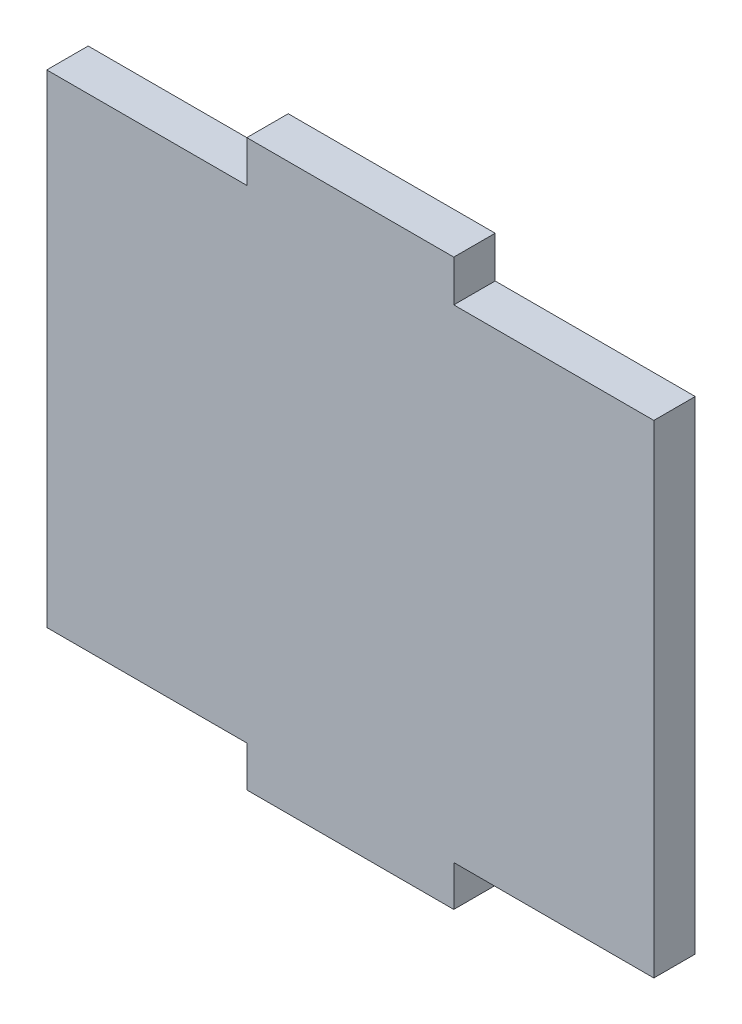
ISO-10303-21;
HEADER;
FILE_DESCRIPTION(('STEP AP214'),'2;1');
FILE_NAME('part.step','',(''),(''),'','','');
FILE_SCHEMA(('AUTOMOTIVE_DESIGN { 1 0 10303 214 1 1 1 1 }'));
ENDSEC;
DATA;
#1=APPLICATION_CONTEXT('core data for automotive mechanical design processes');
#2=APPLICATION_PROTOCOL_DEFINITION('international standard','automotive_design',2000,#1);
#3=PRODUCT_CONTEXT('',#1,'mechanical');
#4=PRODUCT('Part','Part','',(#3));
#5=PRODUCT_RELATED_PRODUCT_CATEGORY('part','',(#4));
#6=PRODUCT_DEFINITION_FORMATION('','',#4);
#7=PRODUCT_DEFINITION_CONTEXT('part definition',#1,'design');
#8=PRODUCT_DEFINITION('design','',#6,#7);
#9=PRODUCT_DEFINITION_SHAPE('','',#8);
#10=(LENGTH_UNIT() NAMED_UNIT(*) SI_UNIT(.MILLI.,.METRE.));
#11=(NAMED_UNIT(*) PLANE_ANGLE_UNIT() SI_UNIT($,.RADIAN.));
#12=(NAMED_UNIT(*) SI_UNIT($,.STERADIAN.) SOLID_ANGLE_UNIT());
#13=UNCERTAINTY_MEASURE_WITH_UNIT(LENGTH_MEASURE(1.E-05),#10,'distance_accuracy_value','');
#14=(GEOMETRIC_REPRESENTATION_CONTEXT(3) GLOBAL_UNCERTAINTY_ASSIGNED_CONTEXT((#13)) GLOBAL_UNIT_ASSIGNED_CONTEXT((#10,
#11,#12)) REPRESENTATION_CONTEXT('',''));
#15=CARTESIAN_POINT('',(0.,0.,0.));
#16=DIRECTION('',(0.,0.,1.));
#17=DIRECTION('',(1.,0.,0.));
#18=AXIS2_PLACEMENT_3D('',#15,#16,#17);
#19=CARTESIAN_POINT('',(7.5,-17.5,3.));
#20=DIRECTION('',(0.,1.,0.));
#21=DIRECTION('',(0.,0.,1.));
#22=AXIS2_PLACEMENT_3D('',#19,#20,#21);
#23=PLANE('',#22);
#24=DIRECTION('',(1.,0.,0.));
#25=VECTOR('',#24,1.);
#26=CARTESIAN_POINT('',(7.5,-17.5,0.));
#27=LINE('',#26,#25);
#28=CARTESIAN_POINT('',(7.5,-17.5,0.));
#29=VERTEX_POINT('',#28);
#30=CARTESIAN_POINT('',(22.,-17.5,0.));
#31=VERTEX_POINT('',#30);
#32=EDGE_CURVE('E155',#29,#31,#27,.T.);
#33=ORIENTED_EDGE('',*,*,#32,.T.);
#34=DIRECTION('',(0.,0.,-1.));
#35=VECTOR('',#34,1.);
#36=CARTESIAN_POINT('',(22.,-17.5,3.));
#37=LINE('',#36,#35);
#38=CARTESIAN_POINT('',(22.,-17.5,3.));
#39=VERTEX_POINT('',#38);
#40=EDGE_CURVE('E11',#39,#31,#37,.T.);
#41=ORIENTED_EDGE('',*,*,#40,.F.);
#42=DIRECTION('',(1.,0.,0.));
#43=VECTOR('',#42,1.);
#44=CARTESIAN_POINT('',(7.5,-17.5,3.));
#45=LINE('',#44,#43);
#46=CARTESIAN_POINT('',(7.5,-17.5,3.));
#47=VERTEX_POINT('',#46);
#48=EDGE_CURVE('E177',#47,#39,#45,.T.);
#49=ORIENTED_EDGE('',*,*,#48,.F.);
#50=DIRECTION('',(0.,0.,-1.));
#51=VECTOR('',#50,1.);
#52=CARTESIAN_POINT('',(7.5,-17.5,3.));
#53=LINE('',#52,#51);
#54=EDGE_CURVE('E151',#47,#29,#53,.T.);
#55=ORIENTED_EDGE('',*,*,#54,.T.);
#56=EDGE_LOOP('',(#33,#41,#49,#55));
#57=FACE_BOUND('',#56,.T.);
#58=ADVANCED_FACE('F35',(#57),#23,.F.);
#59=CARTESIAN_POINT('',(22.,17.5,3.));
#60=DIRECTION('',(-1.,0.,0.));
#61=DIRECTION('',(0.,0.,1.));
#62=AXIS2_PLACEMENT_3D('',#59,#60,#61);
#63=PLANE('',#62);
#64=DIRECTION('',(0.,1.,0.));
#65=VECTOR('',#64,1.);
#66=CARTESIAN_POINT('',(22.,17.5,0.));
#67=LINE('',#66,#65);
#68=CARTESIAN_POINT('',(22.,17.5,0.));
#69=VERTEX_POINT('',#68);
#70=EDGE_CURVE('E158',#31,#69,#67,.T.);
#71=ORIENTED_EDGE('',*,*,#70,.T.);
#72=DIRECTION('',(0.,0.,-1.));
#73=VECTOR('',#72,1.);
#74=CARTESIAN_POINT('',(22.,17.5,3.));
#75=LINE('',#74,#73);
#76=CARTESIAN_POINT('',(22.,17.5,3.));
#77=VERTEX_POINT('',#76);
#78=EDGE_CURVE('E43',#77,#69,#75,.T.);
#79=ORIENTED_EDGE('',*,*,#78,.F.);
#80=DIRECTION('',(0.,1.,0.));
#81=VECTOR('',#80,1.);
#82=CARTESIAN_POINT('',(22.,17.5,3.));
#83=LINE('',#82,#81);
#84=EDGE_CURVE('E106',#39,#77,#83,.T.);
#85=ORIENTED_EDGE('',*,*,#84,.F.);
#86=ORIENTED_EDGE('',*,*,#40,.T.);
#87=EDGE_LOOP('',(#71,#79,#85,#86));
#88=FACE_BOUND('',#87,.T.);
#89=ADVANCED_FACE('F255',(#88),#63,.F.);
#90=CARTESIAN_POINT('',(7.5,17.5,3.));
#91=DIRECTION('',(0.,-1.,0.));
#92=DIRECTION('',(1.,0.,0.));
#93=AXIS2_PLACEMENT_3D('',#90,#91,#92);
#94=PLANE('',#93);
#95=DIRECTION('',(-1.,0.,0.));
#96=VECTOR('',#95,1.);
#97=CARTESIAN_POINT('',(7.5,17.5,0.));
#98=LINE('',#97,#96);
#99=CARTESIAN_POINT('',(7.5,17.5,0.));
#100=VERTEX_POINT('',#99);
#101=EDGE_CURVE('E160',#69,#100,#98,.T.);
#102=ORIENTED_EDGE('',*,*,#101,.T.);
#103=DIRECTION('',(0.,0.,-1.));
#104=VECTOR('',#103,1.);
#105=CARTESIAN_POINT('',(7.5,17.5,3.));
#106=LINE('',#105,#104);
#107=CARTESIAN_POINT('',(7.5,17.5,3.));
#108=VERTEX_POINT('',#107);
#109=EDGE_CURVE('E196',#108,#100,#106,.T.);
#110=ORIENTED_EDGE('',*,*,#109,.F.);
#111=DIRECTION('',(-1.,0.,0.));
#112=VECTOR('',#111,1.);
#113=CARTESIAN_POINT('',(7.5,17.5,3.));
#114=LINE('',#113,#112);
#115=EDGE_CURVE('E204',#77,#108,#114,.T.);
#116=ORIENTED_EDGE('',*,*,#115,.F.);
#117=ORIENTED_EDGE('',*,*,#78,.T.);
#118=EDGE_LOOP('',(#102,#110,#116,#117));
#119=FACE_BOUND('',#118,.T.);
#120=ADVANCED_FACE('F202',(#119),#94,.F.);
#121=CARTESIAN_POINT('',(7.5,20.5,3.));
#122=DIRECTION('',(-1.,0.,0.));
#123=DIRECTION('',(0.,0.,1.));
#124=AXIS2_PLACEMENT_3D('',#121,#122,#123);
#125=PLANE('',#124);
#126=DIRECTION('',(0.,1.,0.));
#127=VECTOR('',#126,1.);
#128=CARTESIAN_POINT('',(7.5,20.5,0.));
#129=LINE('',#128,#127);
#130=CARTESIAN_POINT('',(7.5,20.5,0.));
#131=VERTEX_POINT('',#130);
#132=EDGE_CURVE('E162',#100,#131,#129,.T.);
#133=ORIENTED_EDGE('',*,*,#132,.T.);
#134=DIRECTION('',(0.,0.,-1.));
#135=VECTOR('',#134,1.);
#136=CARTESIAN_POINT('',(7.5,20.5,3.));
#137=LINE('',#136,#135);
#138=CARTESIAN_POINT('',(7.5,20.5,3.));
#139=VERTEX_POINT('',#138);
#140=EDGE_CURVE('E193',#139,#131,#137,.T.);
#141=ORIENTED_EDGE('',*,*,#140,.F.);
#142=DIRECTION('',(0.,1.,0.));
#143=VECTOR('',#142,1.);
#144=CARTESIAN_POINT('',(7.5,20.5,3.));
#145=LINE('',#144,#143);
#146=EDGE_CURVE('E222',#108,#139,#145,.T.);
#147=ORIENTED_EDGE('',*,*,#146,.F.);
#148=ORIENTED_EDGE('',*,*,#109,.T.);
#149=EDGE_LOOP('',(#133,#141,#147,#148));
#150=FACE_BOUND('',#149,.T.);
#151=ADVANCED_FACE('F213',(#150),#125,.F.);
#152=CARTESIAN_POINT('',(-7.5,20.5,3.));
#153=DIRECTION('',(0.,-1.,0.));
#154=DIRECTION('',(0.,0.,-1.));
#155=AXIS2_PLACEMENT_3D('',#152,#153,#154);
#156=PLANE('',#155);
#157=DIRECTION('',(-1.,0.,0.));
#158=VECTOR('',#157,1.);
#159=CARTESIAN_POINT('',(-7.5,20.5,0.));
#160=LINE('',#159,#158);
#161=CARTESIAN_POINT('',(-7.5,20.5,0.));
#162=VERTEX_POINT('',#161);
#163=EDGE_CURVE('E164',#131,#162,#160,.T.);
#164=ORIENTED_EDGE('',*,*,#163,.T.);
#165=DIRECTION('',(0.,0.,-1.));
#166=VECTOR('',#165,1.);
#167=CARTESIAN_POINT('',(-7.5,20.5,3.));
#168=LINE('',#167,#166);
#169=CARTESIAN_POINT('',(-7.5,20.5,3.));
#170=VERTEX_POINT('',#169);
#171=EDGE_CURVE('E190',#170,#162,#168,.T.);
#172=ORIENTED_EDGE('',*,*,#171,.F.);
#173=DIRECTION('',(-1.,0.,0.));
#174=VECTOR('',#173,1.);
#175=CARTESIAN_POINT('',(-7.5,20.5,3.));
#176=LINE('',#175,#174);
#177=EDGE_CURVE('E219',#139,#170,#176,.T.);
#178=ORIENTED_EDGE('',*,*,#177,.F.);
#179=ORIENTED_EDGE('',*,*,#140,.T.);
#180=EDGE_LOOP('',(#164,#172,#178,#179));
#181=FACE_BOUND('',#180,.T.);
#182=ADVANCED_FACE('F217',(#181),#156,.F.);
#183=CARTESIAN_POINT('',(-7.5,20.5,3.));
#184=DIRECTION('',(1.,0.,0.));
#185=DIRECTION('',(0.,0.,-1.));
#186=AXIS2_PLACEMENT_3D('',#183,#184,#185);
#187=PLANE('',#186);
#188=DIRECTION('',(0.,-1.,0.));
#189=VECTOR('',#188,1.);
#190=CARTESIAN_POINT('',(-7.5,20.5,0.));
#191=LINE('',#190,#189);
#192=CARTESIAN_POINT('',(-7.5,17.5,0.));
#193=VERTEX_POINT('',#192);
#194=EDGE_CURVE('E166',#162,#193,#191,.T.);
#195=ORIENTED_EDGE('',*,*,#194,.T.);
#196=DIRECTION('',(0.,0.,-1.));
#197=VECTOR('',#196,1.);
#198=CARTESIAN_POINT('',(-7.5,17.5,3.));
#199=LINE('',#198,#197);
#200=CARTESIAN_POINT('',(-7.5,17.5,3.));
#201=VERTEX_POINT('',#200);
#202=EDGE_CURVE('E187',#201,#193,#199,.T.);
#203=ORIENTED_EDGE('',*,*,#202,.F.);
#204=DIRECTION('',(0.,-1.,0.));
#205=VECTOR('',#204,1.);
#206=CARTESIAN_POINT('',(-7.5,20.5,3.));
#207=LINE('',#206,#205);
#208=EDGE_CURVE('E221',#170,#201,#207,.T.);
#209=ORIENTED_EDGE('',*,*,#208,.F.);
#210=ORIENTED_EDGE('',*,*,#171,.T.);
#211=EDGE_LOOP('',(#195,#203,#209,#210));
#212=FACE_BOUND('',#211,.T.);
#213=ADVANCED_FACE('F268',(#212),#187,.F.);
#214=CARTESIAN_POINT('',(-7.5,17.5,3.));
#215=DIRECTION('',(0.,-1.,0.));
#216=DIRECTION('',(1.,0.,0.));
#217=AXIS2_PLACEMENT_3D('',#214,#215,#216);
#218=PLANE('',#217);
#219=DIRECTION('',(-1.,0.,0.));
#220=VECTOR('',#219,1.);
#221=CARTESIAN_POINT('',(-7.5,17.5,0.));
#222=LINE('',#221,#220);
#223=CARTESIAN_POINT('',(-22.,17.5,0.));
#224=VERTEX_POINT('',#223);
#225=EDGE_CURVE('E168',#193,#224,#222,.T.);
#226=ORIENTED_EDGE('',*,*,#225,.T.);
#227=DIRECTION('',(0.,0.,-1.));
#228=VECTOR('',#227,1.);
#229=CARTESIAN_POINT('',(-22.,17.5,3.));
#230=LINE('',#229,#228);
#231=CARTESIAN_POINT('',(-22.,17.5,3.));
#232=VERTEX_POINT('',#231);
#233=EDGE_CURVE('E184',#232,#224,#230,.T.);
#234=ORIENTED_EDGE('',*,*,#233,.F.);
#235=DIRECTION('',(-1.,0.,0.));
#236=VECTOR('',#235,1.);
#237=CARTESIAN_POINT('',(-7.5,17.5,3.));
#238=LINE('',#237,#236);
#239=EDGE_CURVE('E224',#201,#232,#238,.T.);
#240=ORIENTED_EDGE('',*,*,#239,.F.);
#241=ORIENTED_EDGE('',*,*,#202,.T.);
#242=EDGE_LOOP('',(#226,#234,#240,#241));
#243=FACE_BOUND('',#242,.T.);
#244=ADVANCED_FACE('F271',(#243),#218,.F.);
#245=CARTESIAN_POINT('',(-22.,17.5,3.));
#246=DIRECTION('',(1.,0.,0.));
#247=DIRECTION('',(0.,0.,-1.));
#248=AXIS2_PLACEMENT_3D('',#245,#246,#247);
#249=PLANE('',#248);
#250=DIRECTION('',(0.,-1.,0.));
#251=VECTOR('',#250,1.);
#252=CARTESIAN_POINT('',(-22.,17.5,0.));
#253=LINE('',#252,#251);
#254=CARTESIAN_POINT('',(-22.,-17.5,0.));
#255=VERTEX_POINT('',#254);
#256=EDGE_CURVE('E170',#224,#255,#253,.T.);
#257=ORIENTED_EDGE('',*,*,#256,.T.);
#258=DIRECTION('',(0.,0.,-1.));
#259=VECTOR('',#258,1.);
#260=CARTESIAN_POINT('',(-22.,-17.5,3.));
#261=LINE('',#260,#259);
#262=CARTESIAN_POINT('',(-22.,-17.5,3.));
#263=VERTEX_POINT('',#262);
#264=EDGE_CURVE('E181',#263,#255,#261,.T.);
#265=ORIENTED_EDGE('',*,*,#264,.F.);
#266=DIRECTION('',(0.,-1.,0.));
#267=VECTOR('',#266,1.);
#268=CARTESIAN_POINT('',(-22.,17.5,3.));
#269=LINE('',#268,#267);
#270=EDGE_CURVE('E230',#232,#263,#269,.T.);
#271=ORIENTED_EDGE('',*,*,#270,.F.);
#272=ORIENTED_EDGE('',*,*,#233,.T.);
#273=EDGE_LOOP('',(#257,#265,#271,#272));
#274=FACE_BOUND('',#273,.T.);
#275=ADVANCED_FACE('F236',(#274),#249,.F.);
#276=CARTESIAN_POINT('',(-7.5,-17.5,3.));
#277=DIRECTION('',(0.,1.,0.));
#278=DIRECTION('',(0.,0.,1.));
#279=AXIS2_PLACEMENT_3D('',#276,#277,#278);
#280=PLANE('',#279);
#281=DIRECTION('',(1.,0.,0.));
#282=VECTOR('',#281,1.);
#283=CARTESIAN_POINT('',(-7.5,-17.5,0.));
#284=LINE('',#283,#282);
#285=CARTESIAN_POINT('',(-7.5,-17.5,0.));
#286=VERTEX_POINT('',#285);
#287=EDGE_CURVE('E172',#255,#286,#284,.T.);
#288=ORIENTED_EDGE('',*,*,#287,.T.);
#289=DIRECTION('',(0.,0.,-1.));
#290=VECTOR('',#289,1.);
#291=CARTESIAN_POINT('',(-7.5,-17.5,3.));
#292=LINE('',#291,#290);
#293=CARTESIAN_POINT('',(-7.5,-17.5,3.));
#294=VERTEX_POINT('',#293);
#295=EDGE_CURVE('E146',#294,#286,#292,.T.);
#296=ORIENTED_EDGE('',*,*,#295,.F.);
#297=DIRECTION('',(1.,0.,0.));
#298=VECTOR('',#297,1.);
#299=CARTESIAN_POINT('',(-7.5,-17.5,3.));
#300=LINE('',#299,#298);
#301=EDGE_CURVE('E137',#263,#294,#300,.T.);
#302=ORIENTED_EDGE('',*,*,#301,.F.);
#303=ORIENTED_EDGE('',*,*,#264,.T.);
#304=EDGE_LOOP('',(#288,#296,#302,#303));
#305=FACE_BOUND('',#304,.T.);
#306=ADVANCED_FACE('F240',(#305),#280,.F.);
#307=CARTESIAN_POINT('',(-7.5,-20.4473744875315,3.));
#308=DIRECTION('',(1.,0.,0.));
#309=DIRECTION('',(0.,1.,0.));
#310=AXIS2_PLACEMENT_3D('',#307,#308,#309);
#311=PLANE('',#310);
#312=DIRECTION('',(0.,-1.,0.));
#313=VECTOR('',#312,1.);
#314=CARTESIAN_POINT('',(-7.5,-20.4473744875315,0.));
#315=LINE('',#314,#313);
#316=CARTESIAN_POINT('',(-7.5,-20.4473744875315,0.));
#317=VERTEX_POINT('',#316);
#318=EDGE_CURVE('E145',#286,#317,#315,.T.);
#319=ORIENTED_EDGE('',*,*,#318,.T.);
#320=DIRECTION('',(0.,0.,-1.));
#321=VECTOR('',#320,1.);
#322=CARTESIAN_POINT('',(-7.5,-20.4473744875315,3.));
#323=LINE('',#322,#321);
#324=CARTESIAN_POINT('',(-7.5,-20.4473744875315,3.));
#325=VERTEX_POINT('',#324);
#326=EDGE_CURVE('E142',#325,#317,#323,.T.);
#327=ORIENTED_EDGE('',*,*,#326,.F.);
#328=DIRECTION('',(0.,-1.,0.));
#329=VECTOR('',#328,1.);
#330=CARTESIAN_POINT('',(-7.5,-20.4473744875315,3.));
#331=LINE('',#330,#329);
#332=EDGE_CURVE('E131',#294,#325,#331,.T.);
#333=ORIENTED_EDGE('',*,*,#332,.F.);
#334=ORIENTED_EDGE('',*,*,#295,.T.);
#335=EDGE_LOOP('',(#319,#327,#333,#334));
#336=FACE_BOUND('',#335,.T.);
#337=ADVANCED_FACE('F143',(#336),#311,.F.);
#338=CARTESIAN_POINT('',(-7.5,-20.4473744875315,3.));
#339=DIRECTION('',(0.,1.,0.));
#340=DIRECTION('',(0.,0.,1.));
#341=AXIS2_PLACEMENT_3D('',#338,#339,#340);
#342=PLANE('',#341);
#343=DIRECTION('',(1.,0.,0.));
#344=VECTOR('',#343,1.);
#345=CARTESIAN_POINT('',(-7.5,-20.4473744875315,0.));
#346=LINE('',#345,#344);
#347=CARTESIAN_POINT('',(7.5,-20.4473744875315,0.));
#348=VERTEX_POINT('',#347);
#349=EDGE_CURVE('E92',#317,#348,#346,.T.);
#350=ORIENTED_EDGE('',*,*,#349,.T.);
#351=DIRECTION('',(0.,0.,-1.));
#352=VECTOR('',#351,1.);
#353=CARTESIAN_POINT('',(7.5,-20.4473744875315,3.));
#354=LINE('',#353,#352);
#355=CARTESIAN_POINT('',(7.5,-20.4473744875315,3.));
#356=VERTEX_POINT('',#355);
#357=EDGE_CURVE('E147',#356,#348,#354,.T.);
#358=ORIENTED_EDGE('',*,*,#357,.F.);
#359=DIRECTION('',(1.,0.,0.));
#360=VECTOR('',#359,1.);
#361=CARTESIAN_POINT('',(-7.5,-20.4473744875315,3.));
#362=LINE('',#361,#360);
#363=EDGE_CURVE('E135',#325,#356,#362,.T.);
#364=ORIENTED_EDGE('',*,*,#363,.F.);
#365=ORIENTED_EDGE('',*,*,#326,.T.);
#366=EDGE_LOOP('',(#350,#358,#364,#365));
#367=FACE_BOUND('',#366,.T.);
#368=ADVANCED_FACE('F149',(#367),#342,.F.);
#369=CARTESIAN_POINT('',(7.5,-20.4473744875315,3.));
#370=DIRECTION('',(-1.,0.,0.));
#371=DIRECTION('',(0.,-1.,0.));
#372=AXIS2_PLACEMENT_3D('',#369,#370,#371);
#373=PLANE('',#372);
#374=DIRECTION('',(0.,1.,0.));
#375=VECTOR('',#374,1.);
#376=CARTESIAN_POINT('',(7.5,-20.4473744875315,0.));
#377=LINE('',#376,#375);
#378=EDGE_CURVE('E98',#348,#29,#377,.T.);
#379=ORIENTED_EDGE('',*,*,#378,.T.);
#380=ORIENTED_EDGE('',*,*,#54,.F.);
#381=DIRECTION('',(0.,1.,0.));
#382=VECTOR('',#381,1.);
#383=CARTESIAN_POINT('',(7.5,-20.4473744875315,3.));
#384=LINE('',#383,#382);
#385=EDGE_CURVE('E51',#356,#47,#384,.T.);
#386=ORIENTED_EDGE('',*,*,#385,.F.);
#387=ORIENTED_EDGE('',*,*,#357,.T.);
#388=EDGE_LOOP('',(#379,#380,#386,#387));
#389=FACE_BOUND('',#388,.T.);
#390=ADVANCED_FACE('F244',(#389),#373,.F.);
#391=CARTESIAN_POINT('',(0.,0.,3.));
#392=DIRECTION('',(0.,0.,-1.));
#393=DIRECTION('',(-1.,0.,0.));
#394=AXIS2_PLACEMENT_3D('',#391,#392,#393);
#395=PLANE('',#394);
#396=ORIENTED_EDGE('',*,*,#48,.T.);
#397=ORIENTED_EDGE('',*,*,#84,.T.);
#398=ORIENTED_EDGE('',*,*,#115,.T.);
#399=ORIENTED_EDGE('',*,*,#146,.T.);
#400=ORIENTED_EDGE('',*,*,#177,.T.);
#401=ORIENTED_EDGE('',*,*,#208,.T.);
#402=ORIENTED_EDGE('',*,*,#239,.T.);
#403=ORIENTED_EDGE('',*,*,#270,.T.);
#404=ORIENTED_EDGE('',*,*,#301,.T.);
#405=ORIENTED_EDGE('',*,*,#332,.T.);
#406=ORIENTED_EDGE('',*,*,#363,.T.);
#407=ORIENTED_EDGE('',*,*,#385,.T.);
#408=EDGE_LOOP('',(#396,#397,#398,#399,#400,#401,#402,#403,#404,#405,#406,#407));
#409=FACE_BOUND('',#408,.T.);
#410=ADVANCED_FACE('F133',(#409),#395,.F.);
#411=CARTESIAN_POINT('',(0.,0.,0.));
#412=DIRECTION('',(0.,0.,-1.));
#413=DIRECTION('',(-1.,0.,0.));
#414=AXIS2_PLACEMENT_3D('',#411,#412,#413);
#415=PLANE('',#414);
#416=ORIENTED_EDGE('',*,*,#32,.F.);
#417=ORIENTED_EDGE('',*,*,#378,.F.);
#418=ORIENTED_EDGE('',*,*,#349,.F.);
#419=ORIENTED_EDGE('',*,*,#318,.F.);
#420=ORIENTED_EDGE('',*,*,#287,.F.);
#421=ORIENTED_EDGE('',*,*,#256,.F.);
#422=ORIENTED_EDGE('',*,*,#225,.F.);
#423=ORIENTED_EDGE('',*,*,#194,.F.);
#424=ORIENTED_EDGE('',*,*,#163,.F.);
#425=ORIENTED_EDGE('',*,*,#132,.F.);
#426=ORIENTED_EDGE('',*,*,#101,.F.);
#427=ORIENTED_EDGE('',*,*,#70,.F.);
#428=EDGE_LOOP('',(#416,#417,#418,#419,#420,#421,#422,#423,#424,#425,#426,#427));
#429=FACE_BOUND('',#428,.T.);
#430=ADVANCED_FACE('F208',(#429),#415,.T.);
#431=CLOSED_SHELL('',(#58,#89,#120,#151,#182,#213,#244,#275,#306,#337,#368,#390,#410,#430));
#432=MANIFOLD_SOLID_BREP('B2',#431);
#433=ADVANCED_BREP_SHAPE_REPRESENTATION('',(#18,#432),#14);
#434=SHAPE_DEFINITION_REPRESENTATION(#9,#433);
ENDSEC;
END-ISO-10303-21;
